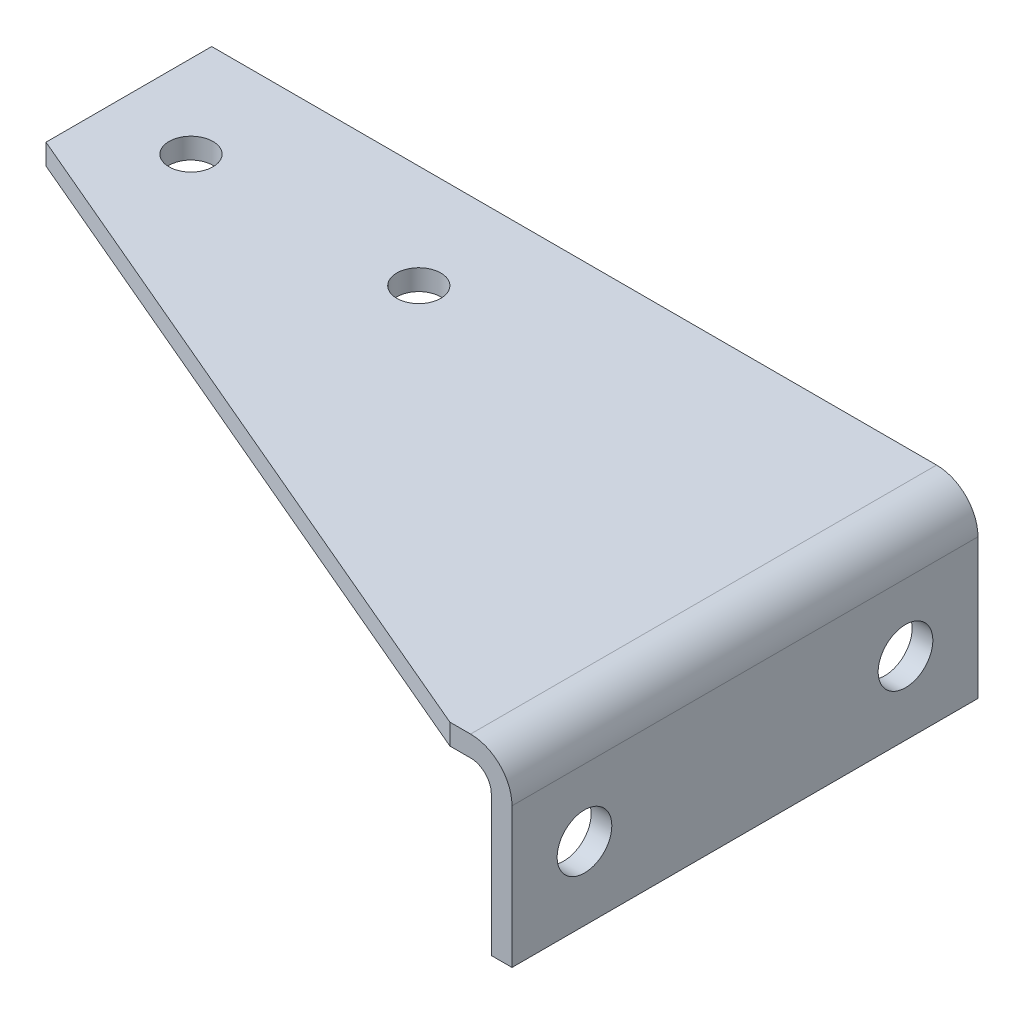
ISO-10303-21;
HEADER;
FILE_DESCRIPTION(('STEP AP214'),'2;1');
FILE_NAME('part.step','',(''),(''),'','','');
FILE_SCHEMA(('AUTOMOTIVE_DESIGN { 1 0 10303 214 1 1 1 1 }'));
ENDSEC;
DATA;
#1=APPLICATION_CONTEXT('core data for automotive mechanical design processes');
#2=APPLICATION_PROTOCOL_DEFINITION('international standard','automotive_design',2000,#1);
#3=PRODUCT_CONTEXT('',#1,'mechanical');
#4=PRODUCT('Part','Part','',(#3));
#5=PRODUCT_RELATED_PRODUCT_CATEGORY('part','',(#4));
#6=PRODUCT_DEFINITION_FORMATION('','',#4);
#7=PRODUCT_DEFINITION_CONTEXT('part definition',#1,'design');
#8=PRODUCT_DEFINITION('design','',#6,#7);
#9=PRODUCT_DEFINITION_SHAPE('','',#8);
#10=(LENGTH_UNIT() NAMED_UNIT(*) SI_UNIT(.MILLI.,.METRE.));
#11=(NAMED_UNIT(*) PLANE_ANGLE_UNIT() SI_UNIT($,.RADIAN.));
#12=(NAMED_UNIT(*) SI_UNIT($,.STERADIAN.) SOLID_ANGLE_UNIT());
#13=UNCERTAINTY_MEASURE_WITH_UNIT(LENGTH_MEASURE(1.E-05),#10,'distance_accuracy_value','');
#14=(GEOMETRIC_REPRESENTATION_CONTEXT(3) GLOBAL_UNCERTAINTY_ASSIGNED_CONTEXT((#13)) GLOBAL_UNIT_ASSIGNED_CONTEXT((#10,
#11,#12)) REPRESENTATION_CONTEXT('',''));
#15=CARTESIAN_POINT('',(0.,0.,0.));
#16=DIRECTION('',(0.,0.,1.));
#17=DIRECTION('',(1.,0.,0.));
#18=AXIS2_PLACEMENT_3D('',#15,#16,#17);
#19=CARTESIAN_POINT('',(0.,-6.35,142.875));
#20=DIRECTION('',(1.,0.,0.));
#21=DIRECTION('',(0.,1.,0.));
#22=AXIS2_PLACEMENT_3D('',#19,#20,#21);
#23=PLANE('',#22);
#24=CARTESIAN_POINT('',(0.,-26.924,120.65));
#25=DIRECTION('',(1.,0.,0.));
#26=DIRECTION('',(0.,1.,0.));
#27=AXIS2_PLACEMENT_3D('',#24,#25,#26);
#28=CIRCLE('',#27,8.382);
#29=CARTESIAN_POINT('',(0.,-18.542,120.65));
#30=VERTEX_POINT('',#29);
#31=EDGE_CURVE('E218',#30,#30,#28,.T.);
#32=ORIENTED_EDGE('',*,*,#31,.T.);
#33=EDGE_LOOP('',(#32));
#34=FACE_BOUND('',#33,.T.);
#35=CARTESIAN_POINT('',(0.,-26.924,22.225));
#36=DIRECTION('',(1.,0.,0.));
#37=DIRECTION('',(0.,1.,0.));
#38=AXIS2_PLACEMENT_3D('',#35,#36,#37);
#39=CIRCLE('',#38,8.382);
#40=CARTESIAN_POINT('',(0.,-18.542,22.225));
#41=VERTEX_POINT('',#40);
#42=EDGE_CURVE('E123',#41,#41,#39,.T.);
#43=ORIENTED_EDGE('',*,*,#42,.T.);
#44=EDGE_LOOP('',(#43));
#45=FACE_BOUND('',#44,.T.);
#46=DIRECTION('',(0.,-1.,0.));
#47=VECTOR('',#46,1.);
#48=CARTESIAN_POINT('',(0.,-6.35,0.));
#49=LINE('',#48,#47);
#50=CARTESIAN_POINT('',(0.,-6.35,0.));
#51=VERTEX_POINT('',#50);
#52=CARTESIAN_POINT('',(0.,-49.276,0.));
#53=VERTEX_POINT('',#52);
#54=EDGE_CURVE('E119',#51,#53,#49,.T.);
#55=ORIENTED_EDGE('',*,*,#54,.T.);
#56=DIRECTION('',(0.,0.,-1.));
#57=VECTOR('',#56,1.);
#58=CARTESIAN_POINT('',(0.,-49.276,142.875));
#59=LINE('',#58,#57);
#60=CARTESIAN_POINT('',(0.,-49.276,142.875));
#61=VERTEX_POINT('',#60);
#62=EDGE_CURVE('E40',#61,#53,#59,.T.);
#63=ORIENTED_EDGE('',*,*,#62,.F.);
#64=DIRECTION('',(0.,-1.,0.));
#65=VECTOR('',#64,1.);
#66=CARTESIAN_POINT('',(0.,-6.35,142.875));
#67=LINE('',#66,#65);
#68=CARTESIAN_POINT('',(0.,-6.35,142.875));
#69=VERTEX_POINT('',#68);
#70=EDGE_CURVE('E148',#69,#61,#67,.T.);
#71=ORIENTED_EDGE('',*,*,#70,.F.);
#72=DIRECTION('',(0.,0.,-1.));
#73=VECTOR('',#72,1.);
#74=CARTESIAN_POINT('',(0.,-6.35,142.875));
#75=LINE('',#74,#73);
#76=EDGE_CURVE('E160',#69,#51,#75,.T.);
#77=ORIENTED_EDGE('',*,*,#76,.T.);
#78=EDGE_LOOP('',(#55,#63,#71,#77));
#79=FACE_BOUND('',#78,.T.);
#80=ADVANCED_FACE('F32',(#34,#45,#79),#23,.F.);
#81=CARTESIAN_POINT('',(6.35000000000001,-49.276,142.875));
#82=DIRECTION('',(0.,-1.,0.));
#83=DIRECTION('',(0.,0.,-1.));
#84=AXIS2_PLACEMENT_3D('',#81,#82,#83);
#85=PLANE('',#84);
#86=DIRECTION('',(-1.,0.,0.));
#87=VECTOR('',#86,1.);
#88=CARTESIAN_POINT('',(6.35000000000001,-49.276,0.));
#89=LINE('',#88,#87);
#90=CARTESIAN_POINT('',(6.35000000000001,-49.276,0.));
#91=VERTEX_POINT('',#90);
#92=EDGE_CURVE('E129',#91,#53,#89,.T.);
#93=ORIENTED_EDGE('',*,*,#92,.F.);
#94=DIRECTION('',(0.,0.,-1.));
#95=VECTOR('',#94,1.);
#96=CARTESIAN_POINT('',(6.35000000000001,-49.276,142.875));
#97=LINE('',#96,#95);
#98=CARTESIAN_POINT('',(6.35000000000001,-49.276,142.875));
#99=VERTEX_POINT('',#98);
#100=EDGE_CURVE('E173',#99,#91,#97,.T.);
#101=ORIENTED_EDGE('',*,*,#100,.F.);
#102=DIRECTION('',(-1.,0.,0.));
#103=VECTOR('',#102,1.);
#104=CARTESIAN_POINT('',(6.35000000000001,-49.276,142.875));
#105=LINE('',#104,#103);
#106=EDGE_CURVE('E150',#99,#61,#105,.T.);
#107=ORIENTED_EDGE('',*,*,#106,.T.);
#108=ORIENTED_EDGE('',*,*,#62,.T.);
#109=EDGE_LOOP('',(#93,#101,#107,#108));
#110=FACE_BOUND('',#109,.T.);
#111=ADVANCED_FACE('F178',(#110),#85,.T.);
#112=CARTESIAN_POINT('',(6.35,-6.35,142.875));
#113=DIRECTION('',(1.,0.,0.));
#114=DIRECTION('',(0.,1.,0.));
#115=AXIS2_PLACEMENT_3D('',#112,#113,#114);
#116=PLANE('',#115);
#117=CARTESIAN_POINT('',(6.35,-26.924,120.65));
#118=DIRECTION('',(1.,0.,0.));
#119=DIRECTION('',(0.,0.,-1.));
#120=AXIS2_PLACEMENT_3D('',#117,#118,#119);
#121=CIRCLE('',#120,8.38200000000001);
#122=CARTESIAN_POINT('',(6.35,-26.924,112.268));
#123=VERTEX_POINT('',#122);
#124=EDGE_CURVE('E227',#123,#123,#121,.T.);
#125=ORIENTED_EDGE('',*,*,#124,.F.);
#126=EDGE_LOOP('',(#125));
#127=FACE_BOUND('',#126,.T.);
#128=CARTESIAN_POINT('',(6.35,-26.924,22.225));
#129=DIRECTION('',(1.,0.,0.));
#130=DIRECTION('',(0.,0.,-1.));
#131=AXIS2_PLACEMENT_3D('',#128,#129,#130);
#132=CIRCLE('',#131,8.38200000000001);
#133=CARTESIAN_POINT('',(6.35,-26.924,13.843));
#134=VERTEX_POINT('',#133);
#135=EDGE_CURVE('E222',#134,#134,#132,.T.);
#136=ORIENTED_EDGE('',*,*,#135,.F.);
#137=EDGE_LOOP('',(#136));
#138=FACE_BOUND('',#137,.T.);
#139=DIRECTION('',(0.,-1.,0.));
#140=VECTOR('',#139,1.);
#141=CARTESIAN_POINT('',(6.35,-6.35,0.));
#142=LINE('',#141,#140);
#143=CARTESIAN_POINT('',(6.35,-6.35,0.));
#144=VERTEX_POINT('',#143);
#145=EDGE_CURVE('E132',#144,#91,#142,.T.);
#146=ORIENTED_EDGE('',*,*,#145,.F.);
#147=DIRECTION('',(0.,0.,-1.));
#148=VECTOR('',#147,1.);
#149=CARTESIAN_POINT('',(6.35,-6.35,142.875));
#150=LINE('',#149,#148);
#151=CARTESIAN_POINT('',(6.35,-6.35,142.875));
#152=VERTEX_POINT('',#151);
#153=EDGE_CURVE('E171',#152,#144,#150,.T.);
#154=ORIENTED_EDGE('',*,*,#153,.F.);
#155=DIRECTION('',(0.,-1.,0.));
#156=VECTOR('',#155,1.);
#157=CARTESIAN_POINT('',(6.35,-6.35,142.875));
#158=LINE('',#157,#156);
#159=EDGE_CURVE('E153',#152,#99,#158,.T.);
#160=ORIENTED_EDGE('',*,*,#159,.T.);
#161=ORIENTED_EDGE('',*,*,#100,.T.);
#162=EDGE_LOOP('',(#146,#154,#160,#161));
#163=FACE_BOUND('',#162,.T.);
#164=ADVANCED_FACE('F190',(#127,#138,#163),#116,.T.);
#165=CARTESIAN_POINT('',(-6.35,-6.35,142.875));
#166=DIRECTION('',(0.,0.,-1.));
#167=DIRECTION('',(-1.,0.,0.));
#168=AXIS2_PLACEMENT_3D('',#165,#166,#167);
#169=CYLINDRICAL_SURFACE('',#168,12.7);
#170=CARTESIAN_POINT('',(-6.35,-6.35,0.));
#171=DIRECTION('',(0.,0.,1.));
#172=DIRECTION('',(1.,0.,0.));
#173=AXIS2_PLACEMENT_3D('',#170,#171,#172);
#174=CIRCLE('',#173,12.7);
#175=CARTESIAN_POINT('',(-6.35,6.35,0.));
#176=VERTEX_POINT('',#175);
#177=EDGE_CURVE('E135',#176,#144,#174,.F.);
#178=ORIENTED_EDGE('',*,*,#177,.F.);
#179=DIRECTION('',(0.,0.,-1.));
#180=VECTOR('',#179,1.);
#181=CARTESIAN_POINT('',(-6.35,6.35,142.875));
#182=LINE('',#181,#180);
#183=CARTESIAN_POINT('',(-6.35,6.35,142.875));
#184=VERTEX_POINT('',#183);
#185=EDGE_CURVE('E169',#184,#176,#182,.T.);
#186=ORIENTED_EDGE('',*,*,#185,.F.);
#187=CARTESIAN_POINT('',(-6.35,-6.35,142.875));
#188=DIRECTION('',(0.,0.,1.));
#189=DIRECTION('',(1.,0.,0.));
#190=AXIS2_PLACEMENT_3D('',#187,#188,#189);
#191=CIRCLE('',#190,12.7);
#192=EDGE_CURVE('E108',#184,#152,#191,.F.);
#193=ORIENTED_EDGE('',*,*,#192,.T.);
#194=ORIENTED_EDGE('',*,*,#153,.T.);
#195=EDGE_LOOP('',(#178,#186,#193,#194));
#196=FACE_BOUND('',#195,.T.);
#197=ADVANCED_FACE('F199',(#196),#169,.T.);
#198=CARTESIAN_POINT('',(-228.6,6.35,142.875));
#199=DIRECTION('',(0.,1.,0.));
#200=DIRECTION('',(0.,0.,1.));
#201=AXIS2_PLACEMENT_3D('',#198,#199,#200);
#202=PLANE('',#201);
#203=CARTESIAN_POINT('',(-203.200000000001,6.35,31.7500000000001));
#204=DIRECTION('',(0.,1.,0.));
#205=DIRECTION('',(0.,0.,1.));
#206=AXIS2_PLACEMENT_3D('',#203,#204,#205);
#207=CIRCLE('',#206,6.74687500000001);
#208=CARTESIAN_POINT('',(-203.200000000001,6.35,38.4968750000001));
#209=VERTEX_POINT('',#208);
#210=EDGE_CURVE('E236',#209,#209,#207,.T.);
#211=ORIENTED_EDGE('',*,*,#210,.F.);
#212=EDGE_LOOP('',(#211));
#213=FACE_BOUND('',#212,.T.);
#214=CARTESIAN_POINT('',(-133.35,6.35,31.75));
#215=DIRECTION('',(0.,1.,0.));
#216=DIRECTION('',(0.,0.,1.));
#217=AXIS2_PLACEMENT_3D('',#214,#215,#216);
#218=CIRCLE('',#217,6.74687500000001);
#219=CARTESIAN_POINT('',(-133.35,6.35,38.496875));
#220=VERTEX_POINT('',#219);
#221=EDGE_CURVE('E230',#220,#220,#218,.T.);
#222=ORIENTED_EDGE('',*,*,#221,.F.);
#223=EDGE_LOOP('',(#222));
#224=FACE_BOUND('',#223,.T.);
#225=DIRECTION('',(-0.919843258058762,0.,-0.39228609534859));
#226=VECTOR('',#225,1.);
#227=CARTESIAN_POINT('',(-195.37549862763,6.35,64.9692726440988));
#228=LINE('',#227,#226);
#229=CARTESIAN_POINT('',(-12.7,6.35000000000002,142.875));
#230=VERTEX_POINT('',#229);
#231=CARTESIAN_POINT('',(-228.6,6.35,50.8));
#232=VERTEX_POINT('',#231);
#233=EDGE_CURVE('E114',#230,#232,#228,.T.);
#234=ORIENTED_EDGE('',*,*,#233,.F.);
#235=DIRECTION('',(1.,0.,0.));
#236=VECTOR('',#235,1.);
#237=CARTESIAN_POINT('',(-228.6,6.35,142.875));
#238=LINE('',#237,#236);
#239=EDGE_CURVE('E103',#230,#184,#238,.T.);
#240=ORIENTED_EDGE('',*,*,#239,.T.);
#241=ORIENTED_EDGE('',*,*,#185,.T.);
#242=DIRECTION('',(1.,0.,0.));
#243=VECTOR('',#242,1.);
#244=CARTESIAN_POINT('',(-228.6,6.35,0.));
#245=LINE('',#244,#243);
#246=CARTESIAN_POINT('',(-228.6,6.35,0.));
#247=VERTEX_POINT('',#246);
#248=EDGE_CURVE('E138',#247,#176,#245,.T.);
#249=ORIENTED_EDGE('',*,*,#248,.F.);
#250=DIRECTION('',(0.,0.,-1.));
#251=VECTOR('',#250,1.);
#252=CARTESIAN_POINT('',(-228.6,6.35,142.875));
#253=LINE('',#252,#251);
#254=EDGE_CURVE('E117',#232,#247,#253,.T.);
#255=ORIENTED_EDGE('',*,*,#254,.F.);
#256=EDGE_LOOP('',(#234,#240,#241,#249,#255));
#257=FACE_BOUND('',#256,.T.);
#258=ADVANCED_FACE('F115',(#213,#224,#257),#202,.T.);
#259=CARTESIAN_POINT('',(-228.6,0.,142.875));
#260=DIRECTION('',(-1.,0.,0.));
#261=DIRECTION('',(0.,0.,1.));
#262=AXIS2_PLACEMENT_3D('',#259,#260,#261);
#263=PLANE('',#262);
#264=DIRECTION('',(0.,-1.,0.));
#265=VECTOR('',#264,1.);
#266=CARTESIAN_POINT('',(-228.6,412.284098421326,50.8));
#267=LINE('',#266,#265);
#268=CARTESIAN_POINT('',(-228.6,0.,50.8));
#269=VERTEX_POINT('',#268);
#270=EDGE_CURVE('E47',#232,#269,#267,.T.);
#271=ORIENTED_EDGE('',*,*,#270,.F.);
#272=ORIENTED_EDGE('',*,*,#254,.T.);
#273=DIRECTION('',(0.,1.,0.));
#274=VECTOR('',#273,1.);
#275=CARTESIAN_POINT('',(-228.6,0.,0.));
#276=LINE('',#275,#274);
#277=CARTESIAN_POINT('',(-228.6,0.,0.));
#278=VERTEX_POINT('',#277);
#279=EDGE_CURVE('E141',#278,#247,#276,.T.);
#280=ORIENTED_EDGE('',*,*,#279,.F.);
#281=DIRECTION('',(0.,0.,-1.));
#282=VECTOR('',#281,1.);
#283=CARTESIAN_POINT('',(-228.6,0.,142.875));
#284=LINE('',#283,#282);
#285=EDGE_CURVE('E166',#269,#278,#284,.T.);
#286=ORIENTED_EDGE('',*,*,#285,.F.);
#287=EDGE_LOOP('',(#271,#272,#280,#286));
#288=FACE_BOUND('',#287,.T.);
#289=ADVANCED_FACE('F197',(#288),#263,.T.);
#290=CARTESIAN_POINT('',(-228.6,0.,142.875));
#291=DIRECTION('',(0.,1.,0.));
#292=DIRECTION('',(0.,0.,1.));
#293=AXIS2_PLACEMENT_3D('',#290,#291,#292);
#294=PLANE('',#293);
#295=CARTESIAN_POINT('',(-203.200000000001,0.,31.7500000000001));
#296=DIRECTION('',(0.,1.,0.));
#297=DIRECTION('',(0.,0.,1.));
#298=AXIS2_PLACEMENT_3D('',#295,#296,#297);
#299=CIRCLE('',#298,6.74687500000001);
#300=CARTESIAN_POINT('',(-203.200000000001,0.,38.4968750000001));
#301=VERTEX_POINT('',#300);
#302=EDGE_CURVE('E233',#301,#301,#299,.T.);
#303=ORIENTED_EDGE('',*,*,#302,.T.);
#304=EDGE_LOOP('',(#303));
#305=FACE_BOUND('',#304,.T.);
#306=CARTESIAN_POINT('',(-133.35,0.,31.75));
#307=DIRECTION('',(0.,1.,0.));
#308=DIRECTION('',(0.,0.,1.));
#309=AXIS2_PLACEMENT_3D('',#306,#307,#308);
#310=CIRCLE('',#309,6.74687500000001);
#311=CARTESIAN_POINT('',(-133.35,0.,38.496875));
#312=VERTEX_POINT('',#311);
#313=EDGE_CURVE('E35',#312,#312,#310,.T.);
#314=ORIENTED_EDGE('',*,*,#313,.T.);
#315=EDGE_LOOP('',(#314));
#316=FACE_BOUND('',#315,.T.);
#317=DIRECTION('',(1.,0.,0.));
#318=VECTOR('',#317,1.);
#319=CARTESIAN_POINT('',(-228.6,0.,142.875));
#320=LINE('',#319,#318);
#321=CARTESIAN_POINT('',(-12.7,0.,142.875));
#322=VERTEX_POINT('',#321);
#323=CARTESIAN_POINT('',(-6.35,0.,142.875));
#324=VERTEX_POINT('',#323);
#325=EDGE_CURVE('E111',#322,#324,#320,.T.);
#326=ORIENTED_EDGE('',*,*,#325,.F.);
#327=DIRECTION('',(-0.919843258058762,0.,-0.39228609534859));
#328=VECTOR('',#327,1.);
#329=CARTESIAN_POINT('',(-195.37549862763,0.,64.9692726440988));
#330=LINE('',#329,#328);
#331=EDGE_CURVE('E55',#322,#269,#330,.T.);
#332=ORIENTED_EDGE('',*,*,#331,.T.);
#333=ORIENTED_EDGE('',*,*,#285,.T.);
#334=DIRECTION('',(1.,0.,0.));
#335=VECTOR('',#334,1.);
#336=CARTESIAN_POINT('',(-228.6,0.,0.));
#337=LINE('',#336,#335);
#338=CARTESIAN_POINT('',(-6.35,0.,0.));
#339=VERTEX_POINT('',#338);
#340=EDGE_CURVE('E144',#278,#339,#337,.T.);
#341=ORIENTED_EDGE('',*,*,#340,.T.);
#342=DIRECTION('',(0.,0.,-1.));
#343=VECTOR('',#342,1.);
#344=CARTESIAN_POINT('',(-6.35,0.,142.875));
#345=LINE('',#344,#343);
#346=EDGE_CURVE('E163',#324,#339,#345,.T.);
#347=ORIENTED_EDGE('',*,*,#346,.F.);
#348=EDGE_LOOP('',(#326,#332,#333,#341,#347));
#349=FACE_BOUND('',#348,.T.);
#350=ADVANCED_FACE('F253',(#305,#316,#349),#294,.F.);
#351=CARTESIAN_POINT('',(-6.35,-6.35,142.875));
#352=DIRECTION('',(0.,0.,-1.));
#353=DIRECTION('',(-1.,0.,0.));
#354=AXIS2_PLACEMENT_3D('',#351,#352,#353);
#355=CYLINDRICAL_SURFACE('',#354,6.35);
#356=CARTESIAN_POINT('',(-6.35,-6.35,0.));
#357=DIRECTION('',(0.,0.,-1.));
#358=DIRECTION('',(-1.,0.,0.));
#359=AXIS2_PLACEMENT_3D('',#356,#357,#358);
#360=CIRCLE('',#359,6.35);
#361=EDGE_CURVE('E146',#339,#51,#360,.T.);
#362=ORIENTED_EDGE('',*,*,#361,.T.);
#363=ORIENTED_EDGE('',*,*,#76,.F.);
#364=CARTESIAN_POINT('',(-6.35,-6.35,142.875));
#365=DIRECTION('',(0.,0.,-1.));
#366=DIRECTION('',(-1.,0.,0.));
#367=AXIS2_PLACEMENT_3D('',#364,#365,#366);
#368=CIRCLE('',#367,6.35);
#369=EDGE_CURVE('E158',#324,#69,#368,.T.);
#370=ORIENTED_EDGE('',*,*,#369,.F.);
#371=ORIENTED_EDGE('',*,*,#346,.T.);
#372=EDGE_LOOP('',(#362,#363,#370,#371));
#373=FACE_BOUND('',#372,.T.);
#374=ADVANCED_FACE('F194',(#373),#355,.F.);
#375=CARTESIAN_POINT('',(-6.35,-6.35,142.875));
#376=DIRECTION('',(0.,0.,1.));
#377=DIRECTION('',(1.,0.,0.));
#378=AXIS2_PLACEMENT_3D('',#375,#376,#377);
#379=PLANE('',#378);
#380=DIRECTION('',(0.,1.,0.));
#381=VECTOR('',#380,1.);
#382=CARTESIAN_POINT('',(-12.7,-6.35,142.875));
#383=LINE('',#382,#381);
#384=EDGE_CURVE('E11',#322,#230,#383,.T.);
#385=ORIENTED_EDGE('',*,*,#384,.F.);
#386=ORIENTED_EDGE('',*,*,#325,.T.);
#387=ORIENTED_EDGE('',*,*,#369,.T.);
#388=ORIENTED_EDGE('',*,*,#70,.T.);
#389=ORIENTED_EDGE('',*,*,#106,.F.);
#390=ORIENTED_EDGE('',*,*,#159,.F.);
#391=ORIENTED_EDGE('',*,*,#192,.F.);
#392=ORIENTED_EDGE('',*,*,#239,.F.);
#393=EDGE_LOOP('',(#385,#386,#387,#388,#389,#390,#391,#392));
#394=FACE_BOUND('',#393,.T.);
#395=ADVANCED_FACE('F105',(#394),#379,.T.);
#396=CARTESIAN_POINT('',(-6.35,-6.35,0.));
#397=DIRECTION('',(0.,0.,1.));
#398=DIRECTION('',(1.,0.,0.));
#399=AXIS2_PLACEMENT_3D('',#396,#397,#398);
#400=PLANE('',#399);
#401=ORIENTED_EDGE('',*,*,#54,.F.);
#402=ORIENTED_EDGE('',*,*,#361,.F.);
#403=ORIENTED_EDGE('',*,*,#340,.F.);
#404=ORIENTED_EDGE('',*,*,#279,.T.);
#405=ORIENTED_EDGE('',*,*,#248,.T.);
#406=ORIENTED_EDGE('',*,*,#177,.T.);
#407=ORIENTED_EDGE('',*,*,#145,.T.);
#408=ORIENTED_EDGE('',*,*,#92,.T.);
#409=EDGE_LOOP('',(#401,#402,#403,#404,#405,#406,#407,#408));
#410=FACE_BOUND('',#409,.T.);
#411=ADVANCED_FACE('F186',(#410),#400,.F.);
#412=CARTESIAN_POINT('',(-228.6,412.284098421326,50.8));
#413=DIRECTION('',(0.39228609534859,0.,-0.919843258058762));
#414=DIRECTION('',(-0.919843258058762,0.,-0.39228609534859));
#415=AXIS2_PLACEMENT_3D('',#412,#413,#414);
#416=PLANE('',#415);
#417=ORIENTED_EDGE('',*,*,#384,.T.);
#418=ORIENTED_EDGE('',*,*,#233,.T.);
#419=ORIENTED_EDGE('',*,*,#270,.T.);
#420=ORIENTED_EDGE('',*,*,#331,.F.);
#421=EDGE_LOOP('',(#417,#418,#419,#420));
#422=FACE_BOUND('',#421,.T.);
#423=ADVANCED_FACE('F121',(#422),#416,.F.);
#424=CARTESIAN_POINT('',(6.35,-26.924,22.225));
#425=DIRECTION('',(1.,0.,0.));
#426=DIRECTION('',(0.,0.,-1.));
#427=AXIS2_PLACEMENT_3D('',#424,#425,#426);
#428=CYLINDRICAL_SURFACE('',#427,8.382);
#429=ORIENTED_EDGE('',*,*,#135,.T.);
#430=EDGE_LOOP('',(#429));
#431=FACE_BOUND('',#430,.T.);
#432=ORIENTED_EDGE('',*,*,#42,.F.);
#433=EDGE_LOOP('',(#432));
#434=FACE_BOUND('',#433,.T.);
#435=ADVANCED_FACE('F270',(#431,#434),#428,.F.);
#436=CARTESIAN_POINT('',(6.35,-26.924,120.65));
#437=DIRECTION('',(1.,0.,0.));
#438=DIRECTION('',(0.,0.,-1.));
#439=AXIS2_PLACEMENT_3D('',#436,#437,#438);
#440=CYLINDRICAL_SURFACE('',#439,8.382);
#441=ORIENTED_EDGE('',*,*,#124,.T.);
#442=EDGE_LOOP('',(#441));
#443=FACE_BOUND('',#442,.T.);
#444=ORIENTED_EDGE('',*,*,#31,.F.);
#445=EDGE_LOOP('',(#444));
#446=FACE_BOUND('',#445,.T.);
#447=ADVANCED_FACE('F248',(#443,#446),#440,.F.);
#448=CARTESIAN_POINT('',(-133.35,6.35,31.75));
#449=DIRECTION('',(0.,1.,0.));
#450=DIRECTION('',(0.,0.,1.));
#451=AXIS2_PLACEMENT_3D('',#448,#449,#450);
#452=CYLINDRICAL_SURFACE('',#451,6.74687500000001);
#453=ORIENTED_EDGE('',*,*,#221,.T.);
#454=EDGE_LOOP('',(#453));
#455=FACE_BOUND('',#454,.T.);
#456=ORIENTED_EDGE('',*,*,#313,.F.);
#457=EDGE_LOOP('',(#456));
#458=FACE_BOUND('',#457,.T.);
#459=ADVANCED_FACE('F245',(#455,#458),#452,.F.);
#460=CARTESIAN_POINT('',(-203.200000000001,6.35,31.7500000000001));
#461=DIRECTION('',(0.,1.,0.));
#462=DIRECTION('',(0.,0.,1.));
#463=AXIS2_PLACEMENT_3D('',#460,#461,#462);
#464=CYLINDRICAL_SURFACE('',#463,6.74687500000001);
#465=ORIENTED_EDGE('',*,*,#210,.T.);
#466=EDGE_LOOP('',(#465));
#467=FACE_BOUND('',#466,.T.);
#468=ORIENTED_EDGE('',*,*,#302,.F.);
#469=EDGE_LOOP('',(#468));
#470=FACE_BOUND('',#469,.T.);
#471=ADVANCED_FACE('F240',(#467,#470),#464,.F.);
#472=CLOSED_SHELL('',(#80,#111,#164,#197,#258,#289,#350,#374,#395,#411,#423,#435,#447,#459,#471));
#473=MANIFOLD_SOLID_BREP('B2',#472);
#474=ADVANCED_BREP_SHAPE_REPRESENTATION('',(#18,#473),#14);
#475=SHAPE_DEFINITION_REPRESENTATION(#9,#474);
ENDSEC;
END-ISO-10303-21;
